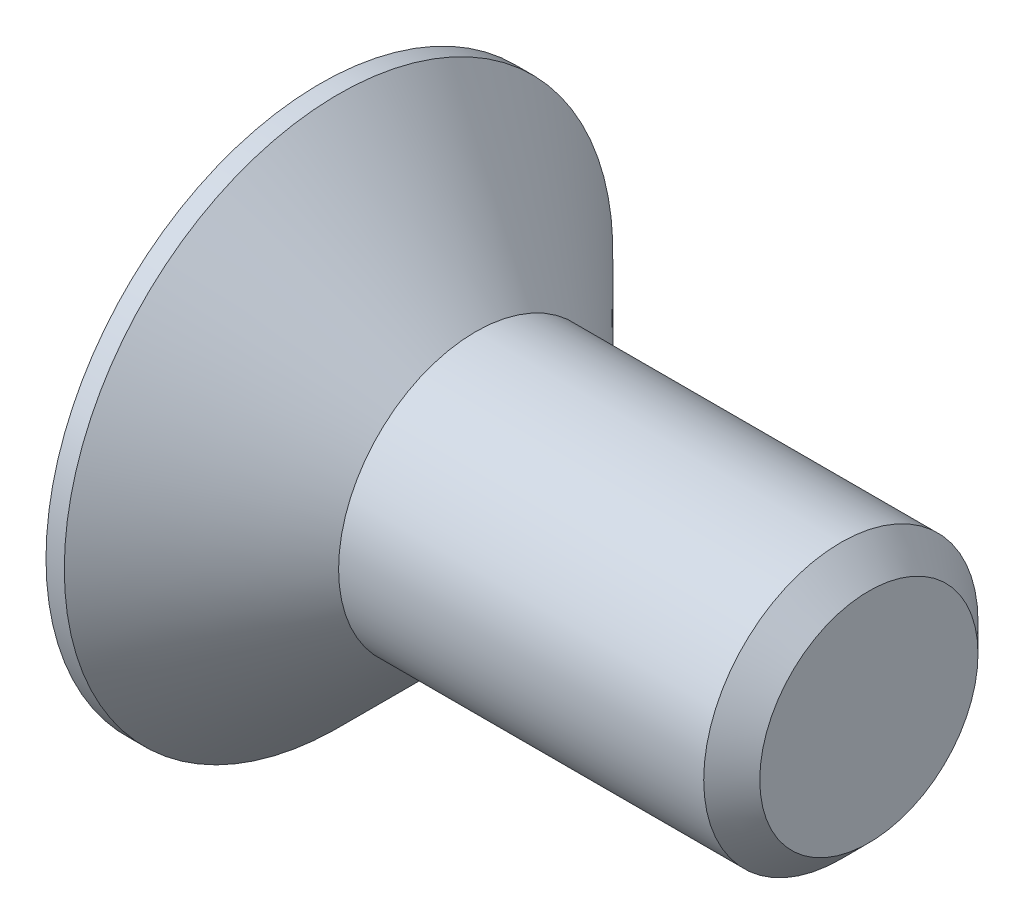
ISO-10303-21;
HEADER;
FILE_DESCRIPTION(('STEP AP214'),'2;1');
FILE_NAME('part.step','',(''),(''),'','','');
FILE_SCHEMA(('AUTOMOTIVE_DESIGN { 1 0 10303 214 1 1 1 1 }'));
ENDSEC;
DATA;
#1=APPLICATION_CONTEXT('core data for automotive mechanical design processes');
#2=APPLICATION_PROTOCOL_DEFINITION('international standard','automotive_design',2000,#1);
#3=PRODUCT_CONTEXT('',#1,'mechanical');
#4=PRODUCT('Part','Part','',(#3));
#5=PRODUCT_RELATED_PRODUCT_CATEGORY('part','',(#4));
#6=PRODUCT_DEFINITION_FORMATION('','',#4);
#7=PRODUCT_DEFINITION_CONTEXT('part definition',#1,'design');
#8=PRODUCT_DEFINITION('design','',#6,#7);
#9=PRODUCT_DEFINITION_SHAPE('','',#8);
#10=(LENGTH_UNIT() NAMED_UNIT(*) SI_UNIT(.MILLI.,.METRE.));
#11=(NAMED_UNIT(*) PLANE_ANGLE_UNIT() SI_UNIT($,.RADIAN.));
#12=(NAMED_UNIT(*) SI_UNIT($,.STERADIAN.) SOLID_ANGLE_UNIT());
#13=UNCERTAINTY_MEASURE_WITH_UNIT(LENGTH_MEASURE(1.E-05),#10,'distance_accuracy_value','');
#14=(GEOMETRIC_REPRESENTATION_CONTEXT(3) GLOBAL_UNCERTAINTY_ASSIGNED_CONTEXT((#13)) GLOBAL_UNIT_ASSIGNED_CONTEXT((#10,
#11,#12)) REPRESENTATION_CONTEXT('',''));
#15=CARTESIAN_POINT('',(0.,0.,0.));
#16=DIRECTION('',(0.,0.,1.));
#17=DIRECTION('',(1.,0.,0.));
#18=AXIS2_PLACEMENT_3D('',#15,#16,#17);
#19=CARTESIAN_POINT('',(4.3,0.,-0.59675));
#20=DIRECTION('',(1.,0.,0.));
#21=DIRECTION('',(0.,0.,-1.));
#22=AXIS2_PLACEMENT_3D('',#19,#20,#21);
#23=PLANE('',#22);
#24=CARTESIAN_POINT('',(4.30000000000064,0.,0.));
#25=DIRECTION('',(-1.,0.,0.));
#26=DIRECTION('',(0.,0.,1.));
#27=AXIS2_PLACEMENT_3D('',#24,#25,#26);
#28=CIRCLE('',#27,1.1934999999994);
#29=CARTESIAN_POINT('',(4.30000000000064,0.,1.1934999999994));
#30=VERTEX_POINT('',#29);
#31=EDGE_CURVE('E19',#30,#30,#28,.T.);
#32=ORIENTED_EDGE('',*,*,#31,.F.);
#33=EDGE_LOOP('',(#32));
#34=FACE_BOUND('',#33,.T.);
#35=ADVANCED_FACE('F16',(#34),#23,.T.);
#36=CARTESIAN_POINT('',(3.99349999997867,0.,0.));
#37=DIRECTION('',(-1.,0.,0.));
#38=DIRECTION('',(0.,0.,1.));
#39=AXIS2_PLACEMENT_3D('',#36,#37,#38);
#40=CONICAL_SURFACE('',#39,1.50000000002137,0.785398163397448);
#41=CARTESIAN_POINT('',(3.9935,0.,0.));
#42=DIRECTION('',(-1.,0.,0.));
#43=DIRECTION('',(0.,0.,1.));
#44=AXIS2_PLACEMENT_3D('',#41,#42,#43);
#45=CIRCLE('',#44,1.5);
#46=CARTESIAN_POINT('',(3.9935,0.,1.5));
#47=VERTEX_POINT('',#46);
#48=EDGE_CURVE('E332',#47,#47,#45,.T.);
#49=ORIENTED_EDGE('',*,*,#48,.F.);
#50=EDGE_LOOP('',(#49));
#51=FACE_BOUND('',#50,.T.);
#52=ORIENTED_EDGE('',*,*,#31,.T.);
#53=EDGE_LOOP('',(#52));
#54=FACE_BOUND('',#53,.T.);
#55=ADVANCED_FACE('F117',(#51,#54),#40,.T.);
#56=CARTESIAN_POINT('',(-0.422649730978719,0.,-2.27373675443232E-10));
#57=DIRECTION('',(-1.,0.,0.));
#58=DIRECTION('',(0.,0.,1.));
#59=AXIS2_PLACEMENT_3D('',#56,#57,#58);
#60=CONICAL_SURFACE('',#59,0.,1.04719755120245);
#61=CARTESIAN_POINT('',(-1.,0.,0.));
#62=DIRECTION('',(-1.,0.,0.));
#63=DIRECTION('',(0.,0.,1.));
#64=AXIS2_PLACEMENT_3D('',#61,#62,#63);
#65=CIRCLE('',#64,1.);
#66=CARTESIAN_POINT('',(-1.,0.,1.));
#67=VERTEX_POINT('',#66);
#68=EDGE_CURVE('E338',#67,#67,#65,.F.);
#69=ORIENTED_EDGE('',*,*,#68,.F.);
#70=EDGE_LOOP('',(#69));
#71=FACE_BOUND('',#70,.T.);
#72=CARTESIAN_POINT('',(-0.422649730893454,0.,-1.4210854715202E-10));
#73=VERTEX_POINT('',#72);
#74=VERTEX_LOOP('',#73);
#75=FACE_BOUND('',#74,.T.);
#76=ADVANCED_FACE('F114',(#71,#75),#60,.F.);
#77=CARTESIAN_POINT('',(1.99675,0.,0.));
#78=DIRECTION('',(-1.,0.,0.));
#79=DIRECTION('',(0.,0.,1.));
#80=AXIS2_PLACEMENT_3D('',#77,#78,#79);
#81=CYLINDRICAL_SURFACE('',#80,1.5);
#82=CARTESIAN_POINT('',(5.6843418860808E-11,0.,0.));
#83=DIRECTION('',(-1.,0.,0.));
#84=DIRECTION('',(0.,0.,-1.));
#85=AXIS2_PLACEMENT_3D('',#82,#83,#84);
#86=CIRCLE('',#85,1.50000000002137);
#87=CARTESIAN_POINT('',(5.6843418860808E-11,0.,-1.50000000002137));
#88=VERTEX_POINT('',#87);
#89=EDGE_CURVE('E335',#88,#88,#86,.T.);
#90=ORIENTED_EDGE('',*,*,#89,.F.);
#91=EDGE_LOOP('',(#90));
#92=FACE_BOUND('',#91,.T.);
#93=ORIENTED_EDGE('',*,*,#48,.T.);
#94=EDGE_LOOP('',(#93));
#95=FACE_BOUND('',#94,.T.);
#96=ADVANCED_FACE('F116',(#92,#95),#81,.T.);
#97=CARTESIAN_POINT('',(-1.7,-1.15470053837925,0.));
#98=DIRECTION('',(0.,-0.866025403784439,0.5));
#99=DIRECTION('',(0.,-0.5,-0.866025403784439));
#100=AXIS2_PLACEMENT_3D('',#97,#98,#99);
#101=PLANE('',#100);
#102=DIRECTION('',(1.,0.,0.));
#103=VECTOR('',#102,1.);
#104=CARTESIAN_POINT('',(-1.7,-0.577350269189626,1.));
#105=LINE('',#104,#103);
#106=CARTESIAN_POINT('',(-1.14759373948567,-0.577350286885905,0.999999969349146));
#107=VERTEX_POINT('',#106);
#108=CARTESIAN_POINT('',(-1.,-0.577350269189626,1.));
#109=VERTEX_POINT('',#108);
#110=EDGE_CURVE('E110',#107,#109,#105,.T.);
#111=ORIENTED_EDGE('',*,*,#110,.T.);
#112=DIRECTION('',(0.,0.5,0.866025403784439));
#113=VECTOR('',#112,1.);
#114=CARTESIAN_POINT('',(-1.,-0.806309265446615,0.603431385632923));
#115=LINE('',#114,#113);
#116=CARTESIAN_POINT('',(-1.0000000000166,-0.806309265331264,0.603431385832717));
#117=VERTEX_POINT('',#116);
#118=EDGE_CURVE('E328',#117,#109,#115,.T.);
#119=ORIENTED_EDGE('',*,*,#118,.F.);
#120=CARTESIAN_POINT('',(-1.14759372178939,-0.577350304582184,0.999999938698292));
#121=CARTESIAN_POINT('',(-1.12954944072011,-0.595412849027873,0.968714694004388));
#122=CARTESIAN_POINT('',(-1.11247494388711,-0.613742226589959,0.93696728079574));
#123=CARTESIAN_POINT('',(-1.08107101419316,-0.65081473605964,0.872755810830176));
#124=CARTESIAN_POINT('',(-1.06672209185628,-0.669553771913611,0.840298848646243));
#125=CARTESIAN_POINT('',(-1.04126381454519,-0.707627146696671,0.774353829106371));
#126=CARTESIAN_POINT('',(-1.03016013131735,-0.726962463341887,0.740864078296425));
#127=CARTESIAN_POINT('',(-1.01188380688286,-0.766239414796476,0.672834402810659));
#128=CARTESIAN_POINT('',(-1.00474129164731,-0.78618451081379,0.638288483146832));
#129=CARTESIAN_POINT('',(-0.999999999989702,-0.806309265444663,0.603431385636304));
#130=B_SPLINE_CURVE_WITH_KNOTS('',3,(#120,#121,#122,#123,#124,#125,#126,#127,#128,#129),
.UNSPECIFIED.,.F.,.F.,(4,2,2,2,4),(0.,0.121192343368842,0.241482464220631,0.361981577456356,
0.483384980238341),.UNSPECIFIED.);
#131=EDGE_CURVE('E90',#107,#117,#130,.T.);
#132=ORIENTED_EDGE('',*,*,#131,.F.);
#133=EDGE_LOOP('',(#111,#119,#132));
#134=FACE_BOUND('',#133,.T.);
#135=ADVANCED_FACE('F125',(#134),#101,.F.);
#136=CARTESIAN_POINT('',(-1.,0.,0.));
#137=DIRECTION('',(-1.,0.,0.));
#138=DIRECTION('',(0.,0.,1.));
#139=AXIS2_PLACEMENT_3D('',#136,#137,#138);
#140=PLANE('',#139);
#141=ORIENTED_EDGE('',*,*,#118,.T.);
#142=DIRECTION('',(0.,1.,0.));
#143=VECTOR('',#142,1.);
#144=CARTESIAN_POINT('',(-1.,-0.577350269189626,1.));
#145=LINE('',#144,#143);
#146=CARTESIAN_POINT('',(-1.00000000001151,-0.119432276863416,1.));
#147=VERTEX_POINT('',#146);
#148=EDGE_CURVE('E321',#109,#147,#145,.T.);
#149=ORIENTED_EDGE('',*,*,#148,.T.);
#150=CARTESIAN_POINT('',(-1.0000000000332,0.,0.));
#151=DIRECTION('',(-1.,0.,0.));
#152=DIRECTION('',(0.,0.,1.));
#153=AXIS2_PLACEMENT_3D('',#150,#151,#152);
#154=CIRCLE('',#153,1.0071067812305);
#155=EDGE_CURVE('E616',#117,#147,#154,.T.);
#156=ORIENTED_EDGE('',*,*,#155,.F.);
#157=EDGE_LOOP('',(#141,#149,#156));
#158=FACE_BOUND('',#157,.T.);
#159=ADVANCED_FACE('F478',(#158),#140,.T.);
#160=CARTESIAN_POINT('',(-1.7,-0.577350269189626,1.));
#161=DIRECTION('',(0.,0.,1.));
#162=DIRECTION('',(1.,0.,0.));
#163=AXIS2_PLACEMENT_3D('',#160,#161,#162);
#164=PLANE('',#163);
#165=ORIENTED_EDGE('',*,*,#148,.F.);
#166=ORIENTED_EDGE('',*,*,#110,.F.);
#167=CARTESIAN_POINT('',(-0.999999999987139,-0.119432276680836,1.00000000000645));
#168=CARTESIAN_POINT('',(-1.00814409308643,-0.188516207510361,1.00000000000219));
#169=CARTESIAN_POINT('',(-1.02327258447582,-0.256227448885397,1.00000000000056));
#170=CARTESIAN_POINT('',(-1.0636670115996,-0.387857291852068,0.999999999999449));
#171=CARTESIAN_POINT('',(-1.08882313241476,-0.45180863545373,0.999999999999949));
#172=CARTESIAN_POINT('',(-1.12215456162329,-0.52470971425236,1.00000000000001));
#173=CARTESIAN_POINT('',(-1.12710949189751,-0.535286905313362,1.));
#174=CARTESIAN_POINT('',(-1.13721167384597,-0.556372617052235,0.999999999999996));
#175=CARTESIAN_POINT('',(-1.14235925727663,-0.56688097885376,0.999999999999991));
#176=CARTESIAN_POINT('',(-1.14759376424623,-0.577350283318192,1.));
#177=B_SPLINE_CURVE_WITH_KNOTS('',3,(#167,#168,#169,#170,#171,#172,#173,#174,#175,#176),
.UNSPECIFIED.,.F.,.F.,(4,2,2,2,4),(0.,0.207588466124368,0.412963431373876,0.448006551946835,
0.483113077965665),.UNSPECIFIED.);
#178=EDGE_CURVE('E205',#147,#107,#177,.T.);
#179=ORIENTED_EDGE('',*,*,#178,.F.);
#180=EDGE_LOOP('',(#165,#166,#179));
#181=FACE_BOUND('',#180,.T.);
#182=ADVANCED_FACE('F471',(#181),#164,.F.);
#183=CARTESIAN_POINT('',(-1.7,-0.577350269189626,-1.));
#184=DIRECTION('',(0.,-0.866025403784439,-0.5));
#185=DIRECTION('',(0.,0.5,-0.866025403784439));
#186=AXIS2_PLACEMENT_3D('',#183,#184,#185);
#187=PLANE('',#186);
#188=DIRECTION('',(1.,0.,0.));
#189=VECTOR('',#188,1.);
#190=CARTESIAN_POINT('',(-1.7,-1.15470053837925,0.));
#191=LINE('',#190,#189);
#192=CARTESIAN_POINT('',(-1.14759373949233,-1.15470052068964,-3.06393051299847E-08));
#193=VERTEX_POINT('',#192);
#194=CARTESIAN_POINT('',(-1.,-1.15470053837925,0.));
#195=VERTEX_POINT('',#194);
#196=EDGE_CURVE('E312',#193,#195,#191,.T.);
#197=ORIENTED_EDGE('',*,*,#196,.T.);
#198=DIRECTION('',(0.,-0.5,0.866025403784438));
#199=VECTOR('',#198,1.);
#200=CARTESIAN_POINT('',(-1.,-0.925741542122263,-0.396568614367076));
#201=LINE('',#200,#199);
#202=CARTESIAN_POINT('',(-1.0000000000166,-0.925741542237614,-0.396568614167282));
#203=VERTEX_POINT('',#202);
#204=EDGE_CURVE('E316',#203,#195,#201,.T.);
#205=ORIENTED_EDGE('',*,*,#204,.F.);
#206=CARTESIAN_POINT('',(-1.14759372180272,-1.15470050300003,-6.12786103922624E-08));
#207=CARTESIAN_POINT('',(-1.12954944073184,-1.13663795855335,-0.0312853059742306));
#208=CARTESIAN_POINT('',(-1.11247494389727,-1.11830858099025,-0.0630327191846376));
#209=CARTESIAN_POINT('',(-1.08107101420043,-1.08123607151849,-0.127244189153799));
#210=CARTESIAN_POINT('',(-1.06672209186221,-1.06249703566346,-0.159701151339567));
#211=CARTESIAN_POINT('',(-1.04126381454874,-1.0244236608782,-0.225646170883251));
#212=CARTESIAN_POINT('',(-1.03016013131987,-1.00508834423184,-0.259135921695176));
#213=CARTESIAN_POINT('',(-1.01188380688374,-0.965811392774883,-0.327165597185042));
#214=CARTESIAN_POINT('',(-1.0047412916476,-0.945866296756342,-0.361711516850995));
#215=CARTESIAN_POINT('',(-0.999999999989702,-0.925741542124215,-0.396568614363695));
#216=B_SPLINE_CURVE_WITH_KNOTS('',3,(#206,#207,#208,#209,#210,#211,#212,#213,#214,#215),
.UNSPECIFIED.,.F.,.F.,(4,2,2,2,4),(0.,0.12119234337633,0.241482464235481,0.361981577478616,
0.483384980268136),.UNSPECIFIED.);
#217=EDGE_CURVE('E190',#193,#203,#216,.T.);
#218=ORIENTED_EDGE('',*,*,#217,.F.);
#219=EDGE_LOOP('',(#197,#205,#218));
#220=FACE_BOUND('',#219,.T.);
#221=ADVANCED_FACE('F463',(#220),#187,.F.);
#222=CARTESIAN_POINT('',(-1.,0.,0.));
#223=DIRECTION('',(-1.,0.,0.));
#224=DIRECTION('',(0.,0.,1.));
#225=AXIS2_PLACEMENT_3D('',#222,#223,#224);
#226=PLANE('',#225);
#227=ORIENTED_EDGE('',*,*,#204,.T.);
#228=DIRECTION('',(0.,-0.5,-0.866025403784439));
#229=VECTOR('',#228,1.);
#230=CARTESIAN_POINT('',(-1.,-1.15470053837925,0.));
#231=LINE('',#230,#229);
#232=CARTESIAN_POINT('',(-1.00000000001151,-0.925741542216146,0.396568614204466));
#233=VERTEX_POINT('',#232);
#234=EDGE_CURVE('E308',#195,#233,#231,.F.);
#235=ORIENTED_EDGE('',*,*,#234,.T.);
#236=CARTESIAN_POINT('',(-1.0000000000332,0.,0.));
#237=DIRECTION('',(-1.,0.,0.));
#238=DIRECTION('',(0.,0.,1.));
#239=AXIS2_PLACEMENT_3D('',#236,#237,#238);
#240=CIRCLE('',#239,1.0071067812305);
#241=EDGE_CURVE('E620',#203,#233,#240,.T.);
#242=ORIENTED_EDGE('',*,*,#241,.F.);
#243=EDGE_LOOP('',(#227,#235,#242));
#244=FACE_BOUND('',#243,.T.);
#245=ADVANCED_FACE('F456',(#244),#226,.T.);
#246=CARTESIAN_POINT('',(-1.7,-1.15470053837925,0.));
#247=DIRECTION('',(0.,-0.866025403784439,0.5));
#248=DIRECTION('',(0.,-0.5,-0.866025403784439));
#249=AXIS2_PLACEMENT_3D('',#246,#247,#248);
#250=PLANE('',#249);
#251=ORIENTED_EDGE('',*,*,#234,.F.);
#252=ORIENTED_EDGE('',*,*,#196,.F.);
#253=CARTESIAN_POINT('',(-0.999999999987139,-0.925741542130439,0.396568614365809));
#254=CARTESIAN_POINT('',(-1.00814409308643,-0.960283507541523,0.336740175272009));
#255=CARTESIAN_POINT('',(-1.02327258447583,-0.994139128227632,0.278100520118625));
#256=CARTESIAN_POINT('',(-1.0636670115996,-1.05995404971,0.164105732212784));
#257=CARTESIAN_POINT('',(-1.08882313241476,-1.09192972151126,0.10872224404786));
#258=CARTESIAN_POINT('',(-1.12215456162545,-1.12838026091299,0.0455880578409002));
#259=CARTESIAN_POINT('',(-1.12710949190191,-1.13366885644582,0.0364279416773376));
#260=CARTESIAN_POINT('',(-1.13721167385503,-1.1442117123199,0.0181671796465418));
#261=CARTESIAN_POINT('',(-1.1423592572881,-1.14946589322297,0.00906667137026032));
#262=CARTESIAN_POINT('',(-1.14759376426018,-1.15470054545748,-1.22598580700511E-08));
#263=B_SPLINE_CURVE_WITH_KNOTS('',3,(#253,#254,#255,#256,#257,#258,#259,#260,#261,#262),
.UNSPECIFIED.,.F.,.F.,(4,2,2,2,4),(0.,0.207588466124403,0.412963431373875,0.448006551962401,
0.483113077996857),.UNSPECIFIED.);
#264=EDGE_CURVE('E181',#233,#193,#263,.T.);
#265=ORIENTED_EDGE('',*,*,#264,.F.);
#266=EDGE_LOOP('',(#251,#252,#265));
#267=FACE_BOUND('',#266,.T.);
#268=ADVANCED_FACE('F449',(#267),#250,.F.);
#269=CARTESIAN_POINT('',(-1.7,0.577350269189626,-1.));
#270=DIRECTION('',(0.,0.,-1.));
#271=DIRECTION('',(-1.,0.,0.));
#272=AXIS2_PLACEMENT_3D('',#269,#270,#271);
#273=PLANE('',#272);
#274=DIRECTION('',(1.,0.,0.));
#275=VECTOR('',#274,1.);
#276=CARTESIAN_POINT('',(-1.7,-0.577350269189626,-1.));
#277=LINE('',#276,#275);
#278=CARTESIAN_POINT('',(-1.14759373949233,-0.577350233810404,-1.));
#279=VERTEX_POINT('',#278);
#280=CARTESIAN_POINT('',(-1.,-0.577350269189626,-1.));
#281=VERTEX_POINT('',#280);
#282=EDGE_CURVE('E299',#279,#281,#277,.T.);
#283=ORIENTED_EDGE('',*,*,#282,.T.);
#284=DIRECTION('',(0.,1.,0.));
#285=VECTOR('',#284,1.);
#286=CARTESIAN_POINT('',(-1.,0.,-1.));
#287=LINE('',#286,#285);
#288=CARTESIAN_POINT('',(-1.0000000000166,-0.119432276906352,-1.));
#289=VERTEX_POINT('',#288);
#290=EDGE_CURVE('E303',#289,#281,#287,.F.);
#291=ORIENTED_EDGE('',*,*,#290,.F.);
#292=CARTESIAN_POINT('',(-1.14759372180272,-0.577350198431181,-1.));
#293=CARTESIAN_POINT('',(-1.12954944073184,-0.541225109537822,-1.));
#294=CARTESIAN_POINT('',(-1.11247494389727,-0.504566354411617,-1.));
#295=CARTESIAN_POINT('',(-1.08107101420043,-0.430421335468103,-1.));
#296=CARTESIAN_POINT('',(-1.06672209186221,-0.392943263758041,-1.));
#297=CARTESIAN_POINT('',(-1.04126381454874,-0.316796514187519,-1.));
#298=CARTESIAN_POINT('',(-1.03016013131987,-0.278125880894804,-1.));
#299=CARTESIAN_POINT('',(-1.01188380688374,-0.199571977980889,-1.));
#300=CARTESIAN_POINT('',(-1.0047412916476,-0.159681785943807,-1.));
#301=CARTESIAN_POINT('',(-0.999999999989702,-0.119432276679554,-1.));
#302=B_SPLINE_CURVE_WITH_KNOTS('',3,(#292,#293,#294,#295,#296,#297,#298,#299,#300,#301),
.UNSPECIFIED.,.F.,.F.,(4,2,2,2,4),(0.,0.12119234337633,0.241482464235481,0.361981577478615,
0.483384980268136),.UNSPECIFIED.);
#303=EDGE_CURVE('E173',#279,#289,#302,.T.);
#304=ORIENTED_EDGE('',*,*,#303,.F.);
#305=EDGE_LOOP('',(#283,#291,#304));
#306=FACE_BOUND('',#305,.T.);
#307=ADVANCED_FACE('F442',(#306),#273,.F.);
#308=CARTESIAN_POINT('',(-1.,0.,0.));
#309=DIRECTION('',(-1.,0.,0.));
#310=DIRECTION('',(0.,0.,1.));
#311=AXIS2_PLACEMENT_3D('',#308,#309,#310);
#312=PLANE('',#311);
#313=ORIENTED_EDGE('',*,*,#290,.T.);
#314=DIRECTION('',(0.,0.5,-0.866025403784439));
#315=VECTOR('',#314,1.);
#316=CARTESIAN_POINT('',(-1.,-0.577350269189626,-1.));
#317=LINE('',#316,#315);
#318=CARTESIAN_POINT('',(-1.00000000001151,-0.806309265352731,-0.603431385795534));
#319=VERTEX_POINT('',#318);
#320=EDGE_CURVE('E289',#281,#319,#317,.F.);
#321=ORIENTED_EDGE('',*,*,#320,.T.);
#322=CARTESIAN_POINT('',(-1.0000000000332,0.,0.));
#323=DIRECTION('',(-1.,0.,0.));
#324=DIRECTION('',(0.,0.,1.));
#325=AXIS2_PLACEMENT_3D('',#322,#323,#324);
#326=CIRCLE('',#325,1.0071067812305);
#327=EDGE_CURVE('E627',#289,#319,#326,.T.);
#328=ORIENTED_EDGE('',*,*,#327,.F.);
#329=EDGE_LOOP('',(#313,#321,#328));
#330=FACE_BOUND('',#329,.T.);
#331=ADVANCED_FACE('F435',(#330),#312,.T.);
#332=CARTESIAN_POINT('',(-1.7,-0.577350269189626,-1.));
#333=DIRECTION('',(0.,-0.866025403784439,-0.5));
#334=DIRECTION('',(0.,0.5,-0.866025403784439));
#335=AXIS2_PLACEMENT_3D('',#332,#333,#334);
#336=PLANE('',#335);
#337=ORIENTED_EDGE('',*,*,#320,.F.);
#338=ORIENTED_EDGE('',*,*,#282,.F.);
#339=CARTESIAN_POINT('',(-0.999999999987139,-0.806309265449604,-0.603431385640638));
#340=CARTESIAN_POINT('',(-1.00814409308643,-0.771767300031146,-0.663259824730181));
#341=CARTESIAN_POINT('',(-1.02327258447583,-0.73791167934221,-0.721899479881933));
#342=CARTESIAN_POINT('',(-1.0636670115996,-0.672096757857918,-0.835894267786666));
#343=CARTESIAN_POINT('',(-1.08882313241476,-0.640121086057528,-0.89127775595209));
#344=CARTESIAN_POINT('',(-1.12215456162545,-0.603670546655906,-0.954411942159109));
#345=CARTESIAN_POINT('',(-1.12710949190191,-0.598381951123063,-0.963572058322667));
#346=CARTESIAN_POINT('',(-1.13721167385503,-0.58783909524897,-0.981832820353454));
#347=CARTESIAN_POINT('',(-1.1423592572881,-0.582584914345895,-0.990933328629731));
#348=CARTESIAN_POINT('',(-1.14759376426018,-0.577350262111394,-1.00000001225986));
#349=B_SPLINE_CURVE_WITH_KNOTS('',3,(#339,#340,#341,#342,#343,#344,#345,#346,#347,#348),
.UNSPECIFIED.,.F.,.F.,(4,2,2,2,4),(0.,0.207588466124403,0.412963431373875,0.448006551962401,
0.483113077996856),.UNSPECIFIED.);
#350=EDGE_CURVE('E164',#319,#279,#349,.T.);
#351=ORIENTED_EDGE('',*,*,#350,.F.);
#352=EDGE_LOOP('',(#337,#338,#351));
#353=FACE_BOUND('',#352,.T.);
#354=ADVANCED_FACE('F263',(#353),#336,.F.);
#355=CARTESIAN_POINT('',(-1.7,0.577350269189626,1.));
#356=DIRECTION('',(0.,0.866025403784439,0.5));
#357=DIRECTION('',(0.,-0.5,0.866025403784439));
#358=AXIS2_PLACEMENT_3D('',#355,#356,#357);
#359=PLANE('',#358);
#360=DIRECTION('',(1.,0.,0.));
#361=VECTOR('',#360,1.);
#362=CARTESIAN_POINT('',(-1.7,1.15470053837925,0.));
#363=LINE('',#362,#361);
#364=CARTESIAN_POINT('',(-1.14759373948839,1.1547005206857,3.06461281133559E-08));
#365=VERTEX_POINT('',#364);
#366=CARTESIAN_POINT('',(-1.,1.15470053837925,0.));
#367=VERTEX_POINT('',#366);
#368=EDGE_CURVE('E283',#365,#367,#363,.T.);
#369=ORIENTED_EDGE('',*,*,#368,.T.);
#370=DIRECTION('',(0.,0.5,-0.866025403784438));
#371=VECTOR('',#370,1.);
#372=CARTESIAN_POINT('',(-1.,0.925741542122263,0.396568614367076));
#373=LINE('',#372,#371);
#374=CARTESIAN_POINT('',(-1.0000000000166,0.925741542237614,0.396568614167282));
#375=VERTEX_POINT('',#374);
#376=EDGE_CURVE('E285',#375,#367,#373,.T.);
#377=ORIENTED_EDGE('',*,*,#376,.F.);
#378=CARTESIAN_POINT('',(-1.14759372179302,1.15470050299621,6.12935451049619E-08));
#379=CARTESIAN_POINT('',(-1.12954944072428,1.13663795854755,0.0312853059872758));
#380=CARTESIAN_POINT('',(-1.11247494389114,1.11830858098399,0.0630327191962706));
#381=CARTESIAN_POINT('',(-1.08107101419636,1.0812360715127,0.127244189163026));
#382=CARTESIAN_POINT('',(-1.0667220918588,1.06249703565858,0.159701151347798));
#383=CARTESIAN_POINT('',(-1.04126381454662,1.02442366087482,0.225646170889331));
#384=CARTESIAN_POINT('',(-1.03016013131837,1.00508834422906,0.259135921700099));
#385=CARTESIAN_POINT('',(-1.01188380688325,0.965811392773371,0.327165597187546));
#386=CARTESIAN_POINT('',(-1.00474129164748,0.945866296755493,0.361711516852233));
#387=CARTESIAN_POINT('',(-0.999999999989702,0.925741542124215,0.396568614363696));
#388=B_SPLINE_CURVE_WITH_KNOTS('',3,(#378,#379,#380,#381,#382,#383,#384,#385,#386,#387),
.UNSPECIFIED.,.F.,.F.,(4,2,2,2,4),(0.,0.121192343371831,0.241482464226626,0.361981577465498,
0.483384980250595),.UNSPECIFIED.);
#389=EDGE_CURVE('E267',#365,#375,#388,.T.);
#390=ORIENTED_EDGE('',*,*,#389,.F.);
#391=EDGE_LOOP('',(#369,#377,#390));
#392=FACE_BOUND('',#391,.T.);
#393=ADVANCED_FACE('F259',(#392),#359,.F.);
#394=CARTESIAN_POINT('',(-1.,0.,0.));
#395=DIRECTION('',(-1.,0.,0.));
#396=DIRECTION('',(0.,0.,1.));
#397=AXIS2_PLACEMENT_3D('',#394,#395,#396);
#398=PLANE('',#397);
#399=ORIENTED_EDGE('',*,*,#376,.T.);
#400=DIRECTION('',(0.,0.5,0.866025403784439));
#401=VECTOR('',#400,1.);
#402=CARTESIAN_POINT('',(-1.,1.15470053837925,0.));
#403=LINE('',#402,#401);
#404=CARTESIAN_POINT('',(-1.00000000001151,0.925741542216146,-0.396568614204466));
#405=VERTEX_POINT('',#404);
#406=EDGE_CURVE('E282',#367,#405,#403,.F.);
#407=ORIENTED_EDGE('',*,*,#406,.T.);
#408=CARTESIAN_POINT('',(-1.0000000000332,0.,0.));
#409=DIRECTION('',(-1.,0.,0.));
#410=DIRECTION('',(0.,0.,1.));
#411=AXIS2_PLACEMENT_3D('',#408,#409,#410);
#412=CIRCLE('',#411,1.0071067812305);
#413=EDGE_CURVE('E273',#375,#405,#412,.T.);
#414=ORIENTED_EDGE('',*,*,#413,.F.);
#415=EDGE_LOOP('',(#399,#407,#414));
#416=FACE_BOUND('',#415,.T.);
#417=ADVANCED_FACE('F255',(#416),#398,.T.);
#418=CARTESIAN_POINT('',(-1.7,1.15470053837925,0.));
#419=DIRECTION('',(0.,0.866025403784439,-0.5));
#420=DIRECTION('',(0.,0.5,0.866025403784439));
#421=AXIS2_PLACEMENT_3D('',#418,#419,#420);
#422=PLANE('',#421);
#423=ORIENTED_EDGE('',*,*,#406,.F.);
#424=ORIENTED_EDGE('',*,*,#368,.F.);
#425=CARTESIAN_POINT('',(-0.999999999987139,0.925741542130439,-0.396568614365809));
#426=CARTESIAN_POINT('',(-1.00814409308644,0.960283507541529,-0.336740175272));
#427=CARTESIAN_POINT('',(-1.02327258447583,0.99413912822764,-0.278100520118612));
#428=CARTESIAN_POINT('',(-1.06366701159961,1.05995404971001,-0.164105732212774));
#429=CARTESIAN_POINT('',(-1.08882313241477,1.09192972151126,-0.108722244047858));
#430=CARTESIAN_POINT('',(-1.12215456162667,1.12838026091432,-0.0455880578385909));
#431=CARTESIAN_POINT('',(-1.1271094919044,1.13366885644848,-0.03642794167274));
#432=CARTESIAN_POINT('',(-1.13721167386015,1.14421171232518,-0.0181671796373971));
#433=CARTESIAN_POINT('',(-1.14235925729458,1.14946589322955,-0.00906667135885673));
#434=CARTESIAN_POINT('',(-1.14759376426805,1.15470054546536,1.22735038750435E-08));
#435=B_SPLINE_CURVE_WITH_KNOTS('',3,(#425,#426,#427,#428,#429,#430,#431,#432,#433,#434),
.UNSPECIFIED.,.F.,.F.,(4,2,2,2,4),(0.,0.207588466124423,0.412963431373874,0.448006551971193,
0.483113078014473),.UNSPECIFIED.);
#436=EDGE_CURVE('E152',#405,#365,#435,.T.);
#437=ORIENTED_EDGE('',*,*,#436,.F.);
#438=EDGE_LOOP('',(#423,#424,#437));
#439=FACE_BOUND('',#438,.T.);
#440=ADVANCED_FACE('F248',(#439),#422,.F.);
#441=CARTESIAN_POINT('',(-1.7,0.577350269189626,1.));
#442=DIRECTION('',(0.,0.866025403784439,0.5));
#443=DIRECTION('',(0.,-0.5,0.866025403784439));
#444=AXIS2_PLACEMENT_3D('',#441,#442,#443);
#445=PLANE('',#444);
#446=DIRECTION('',(0.,0.5,-0.866025403784439));
#447=VECTOR('',#446,1.);
#448=CARTESIAN_POINT('',(-1.,0.577350269189626,1.));
#449=LINE('',#448,#447);
#450=CARTESIAN_POINT('',(-1.,0.577350269189626,1.));
#451=VERTEX_POINT('',#450);
#452=CARTESIAN_POINT('',(-1.00000000001151,0.806309265352731,0.603431385795534));
#453=VERTEX_POINT('',#452);
#454=EDGE_CURVE('E361',#451,#453,#449,.T.);
#455=ORIENTED_EDGE('',*,*,#454,.F.);
#456=DIRECTION('',(1.,0.,0.));
#457=VECTOR('',#456,1.);
#458=CARTESIAN_POINT('',(-1.7,0.577350269189626,1.));
#459=LINE('',#458,#457);
#460=CARTESIAN_POINT('',(-1.14759376072143,0.57735027626859,1.));
#461=VERTEX_POINT('',#460);
#462=EDGE_CURVE('E287',#451,#461,#459,.F.);
#463=ORIENTED_EDGE('',*,*,#462,.T.);
#464=CARTESIAN_POINT('',(-0.999999999987139,0.806309265449604,0.603431385640638));
#465=CARTESIAN_POINT('',(-1.00814409307334,0.771767300058917,0.663259824682081));
#466=CARTESIAN_POINT('',(-1.02327258445552,0.73791167938261,0.721899479811959));
#467=CARTESIAN_POINT('',(-1.06366701157717,0.672096757887245,0.835894267735871));
#468=CARTESIAN_POINT('',(-1.0888231324082,0.640121086064763,0.891277755939559));
#469=CARTESIAN_POINT('',(-1.12215455505538,0.603670553840786,0.954411929714533));
#470=CARTESIAN_POINT('',(-1.12710947850026,0.598381965427245,0.963572033547098));
#471=CARTESIAN_POINT('',(-1.13721164628675,0.587839123701442,0.981832771072329));
#472=CARTESIAN_POINT('',(-1.14235922238343,0.582584949827026,0.990933267174609));
#473=CARTESIAN_POINT('',(-1.14759372180199,0.577350304569579,0.999999938720124));
#474=B_SPLINE_CURVE_WITH_KNOTS('',3,(#464,#465,#466,#467,#468,#469,#470,#471,#472,#473),
.UNSPECIFIED.,.F.,.F.,(4,2,2,2,4),(0.,0.207588466015654,0.412963431374018,0.448006504583425,
0.48311298306106),.UNSPECIFIED.);
#475=EDGE_CURVE('E237',#453,#461,#474,.T.);
#476=ORIENTED_EDGE('',*,*,#475,.F.);
#477=EDGE_LOOP('',(#455,#463,#476));
#478=FACE_BOUND('',#477,.T.);
#479=ADVANCED_FACE('F244',(#478),#445,.F.);
#480=CARTESIAN_POINT('',(-1.7,-0.577350269189626,1.));
#481=DIRECTION('',(0.,0.,1.));
#482=DIRECTION('',(1.,0.,0.));
#483=AXIS2_PLACEMENT_3D('',#480,#481,#482);
#484=PLANE('',#483);
#485=ORIENTED_EDGE('',*,*,#462,.F.);
#486=DIRECTION('',(0.,1.,0.));
#487=VECTOR('',#486,1.);
#488=CARTESIAN_POINT('',(-1.,0.,1.));
#489=LINE('',#488,#487);
#490=CARTESIAN_POINT('',(-1.0000000000166,0.119432276906352,1.));
#491=VERTEX_POINT('',#490);
#492=EDGE_CURVE('E366',#491,#451,#489,.T.);
#493=ORIENTED_EDGE('',*,*,#492,.F.);
#494=CARTESIAN_POINT('',(-1.14759376426091,0.577350283347552,1.));
#495=CARTESIAN_POINT('',(-1.12954947806241,0.54122518814395,1.));
#496=CARTESIAN_POINT('',(-1.1124749762567,0.504566426547776,1.));
#497=CARTESIAN_POINT('',(-1.08107103734025,0.430421394380608,1.));
#498=CARTESIAN_POINT('',(-1.06672211074387,0.39294331592187,1.));
#499=CARTESIAN_POINT('',(-1.04126382587046,0.31679655233508,1.));
#500=CARTESIAN_POINT('',(-1.03016013934441,0.278125911772944,1.));
#501=CARTESIAN_POINT('',(-1.01188380970324,0.199571993781325,1.));
#502=CARTESIAN_POINT('',(-1.00474129257757,0.15968179393113,1.));
#503=CARTESIAN_POINT('',(-0.999999999989702,0.119432276679554,1.));
#504=B_SPLINE_CURVE_WITH_KNOTS('',3,(#494,#495,#496,#497,#498,#499,#500,#501,#502,#503),
.UNSPECIFIED.,.F.,.F.,(4,2,2,2,4),(0.,0.121192367218787,0.241482511518817,0.36198164835083,
0.483385075133428),.UNSPECIFIED.);
#505=EDGE_CURVE('E231',#461,#491,#504,.T.);
#506=ORIENTED_EDGE('',*,*,#505,.F.);
#507=EDGE_LOOP('',(#485,#493,#506));
#508=FACE_BOUND('',#507,.T.);
#509=ADVANCED_FACE('F247',(#508),#484,.F.);
#510=CARTESIAN_POINT('',(-1.,0.,0.));
#511=DIRECTION('',(-1.,0.,0.));
#512=DIRECTION('',(0.,0.,1.));
#513=AXIS2_PLACEMENT_3D('',#510,#511,#512);
#514=PLANE('',#513);
#515=ORIENTED_EDGE('',*,*,#492,.T.);
#516=ORIENTED_EDGE('',*,*,#454,.T.);
#517=CARTESIAN_POINT('',(-1.0000000000332,0.,0.));
#518=DIRECTION('',(-1.,0.,0.));
#519=DIRECTION('',(0.,0.,1.));
#520=AXIS2_PLACEMENT_3D('',#517,#518,#519);
#521=CIRCLE('',#520,1.0071067812305);
#522=EDGE_CURVE('E382',#491,#453,#521,.T.);
#523=ORIENTED_EDGE('',*,*,#522,.F.);
#524=EDGE_LOOP('',(#515,#516,#523));
#525=FACE_BOUND('',#524,.T.);
#526=ADVANCED_FACE('F404',(#525),#514,.T.);
#527=CARTESIAN_POINT('',(-1.7,1.15470053837925,0.));
#528=DIRECTION('',(0.,0.866025403784439,-0.5));
#529=DIRECTION('',(0.,0.5,0.866025403784439));
#530=AXIS2_PLACEMENT_3D('',#527,#528,#529);
#531=PLANE('',#530);
#532=DIRECTION('',(-1.,0.,0.));
#533=VECTOR('',#532,1.);
#534=CARTESIAN_POINT('',(-1.7,0.577350269189626,-1.));
#535=LINE('',#534,#533);
#536=CARTESIAN_POINT('',(-1.14759373949249,0.577350286879084,-0.999999969360961));
#537=VERTEX_POINT('',#536);
#538=CARTESIAN_POINT('',(-1.,0.577350269189626,-1.));
#539=VERTEX_POINT('',#538);
#540=EDGE_CURVE('E97',#537,#539,#535,.F.);
#541=ORIENTED_EDGE('',*,*,#540,.T.);
#542=DIRECTION('',(0.,-0.5,-0.866025403784439));
#543=VECTOR('',#542,1.);
#544=CARTESIAN_POINT('',(-1.,0.806309265446615,-0.603431385632923));
#545=LINE('',#544,#543);
#546=CARTESIAN_POINT('',(-1.0000000000166,0.806309265331264,-0.603431385832717));
#547=VERTEX_POINT('',#546);
#548=EDGE_CURVE('E357',#547,#539,#545,.T.);
#549=ORIENTED_EDGE('',*,*,#548,.F.);
#550=CARTESIAN_POINT('',(-1.14759372180303,0.577350304568541,-0.999999938721921));
#551=CARTESIAN_POINT('',(-1.12954944073211,0.595412849015244,-0.968714694026261));
#552=CARTESIAN_POINT('',(-1.11247494389751,0.61374222657837,-0.936967280815814));
#553=CARTESIAN_POINT('',(-1.08107101420059,0.650814736050175,-0.872755810846569));
#554=CARTESIAN_POINT('',(-1.06672209186234,0.66955377190523,-0.840298848660759));
#555=CARTESIAN_POINT('',(-1.04126381454882,0.707627146690542,-0.774353829116987));
#556=CARTESIAN_POINT('',(-1.03016013131993,0.726962463336926,-0.740864078305017));
#557=CARTESIAN_POINT('',(-1.01188380688376,0.766239414793938,-0.672834402815056));
#558=CARTESIAN_POINT('',(-1.00474129164761,0.786184510812507,-0.638288483149055));
#559=CARTESIAN_POINT('',(-0.999999999989702,0.806309265444663,-0.603431385636304));
#560=B_SPLINE_CURVE_WITH_KNOTS('',3,(#550,#551,#552,#553,#554,#555,#556,#557,#558,#559),
.UNSPECIFIED.,.F.,.F.,(4,2,2,2,4),(0.,0.121192343376503,0.241482464235823,0.361981577479129,
0.483384980268822),.UNSPECIFIED.);
#561=EDGE_CURVE('E223',#537,#547,#560,.T.);
#562=ORIENTED_EDGE('',*,*,#561,.F.);
#563=EDGE_LOOP('',(#541,#549,#562));
#564=FACE_BOUND('',#563,.T.);
#565=ADVANCED_FACE('F399',(#564),#531,.F.);
#566=CARTESIAN_POINT('',(-1.,0.,0.));
#567=DIRECTION('',(-1.,0.,0.));
#568=DIRECTION('',(0.,0.,1.));
#569=AXIS2_PLACEMENT_3D('',#566,#567,#568);
#570=PLANE('',#569);
#571=ORIENTED_EDGE('',*,*,#548,.T.);
#572=DIRECTION('',(0.,1.,0.));
#573=VECTOR('',#572,1.);
#574=CARTESIAN_POINT('',(-1.,0.577350269189626,-1.));
#575=LINE('',#574,#573);
#576=CARTESIAN_POINT('',(-1.00000000001151,0.119432276863416,-1.));
#577=VERTEX_POINT('',#576);
#578=EDGE_CURVE('E34',#539,#577,#575,.F.);
#579=ORIENTED_EDGE('',*,*,#578,.T.);
#580=CARTESIAN_POINT('',(-1.0000000000332,0.,0.));
#581=DIRECTION('',(-1.,0.,0.));
#582=DIRECTION('',(0.,0.,1.));
#583=AXIS2_PLACEMENT_3D('',#580,#581,#582);
#584=CIRCLE('',#583,1.0071067812305);
#585=EDGE_CURVE('E385',#547,#577,#584,.T.);
#586=ORIENTED_EDGE('',*,*,#585,.F.);
#587=EDGE_LOOP('',(#571,#579,#586));
#588=FACE_BOUND('',#587,.T.);
#589=ADVANCED_FACE('F393',(#588),#570,.T.);
#590=CARTESIAN_POINT('',(-1.7,0.577350269189626,-1.));
#591=DIRECTION('',(0.,0.,-1.));
#592=DIRECTION('',(-1.,0.,0.));
#593=AXIS2_PLACEMENT_3D('',#590,#591,#592);
#594=PLANE('',#593);
#595=ORIENTED_EDGE('',*,*,#578,.F.);
#596=ORIENTED_EDGE('',*,*,#540,.F.);
#597=CARTESIAN_POINT('',(-0.999999999987139,0.119432276680836,-1.00000000000645));
#598=CARTESIAN_POINT('',(-1.00814409308643,0.188516207510379,-1.00000000000219));
#599=CARTESIAN_POINT('',(-1.02327258447583,0.256227448885423,-1.00000000000056));
#600=CARTESIAN_POINT('',(-1.06366701159961,0.387857291852087,-0.999999999999449));
#601=CARTESIAN_POINT('',(-1.08882313241476,0.451808635453734,-0.999999999999949));
#602=CARTESIAN_POINT('',(-1.1221545616254,0.524709714256977,-1.00000000000001));
#603=CARTESIAN_POINT('',(-1.12710949190181,0.535286905322554,-1.));
#604=CARTESIAN_POINT('',(-1.13721167385483,0.556372617070519,-0.999999999999996));
#605=CARTESIAN_POINT('',(-1.14235925728785,0.566880978876562,-0.999999999999991));
#606=CARTESIAN_POINT('',(-1.14759376425987,0.577350283345478,-1.));
#607=B_SPLINE_CURVE_WITH_KNOTS('',3,(#597,#598,#599,#600,#601,#602,#603,#604,#605,#606),
.UNSPECIFIED.,.F.,.F.,(4,2,2,2,4),(0.,0.207588466124403,0.412963431373875,0.448006551962058,
0.48311307799617),.UNSPECIFIED.);
#608=EDGE_CURVE('E213',#577,#537,#607,.T.);
#609=ORIENTED_EDGE('',*,*,#608,.F.);
#610=EDGE_LOOP('',(#595,#596,#609));
#611=FACE_BOUND('',#610,.T.);
#612=ADVANCED_FACE('F390',(#611),#594,.F.);
#613=CARTESIAN_POINT('',(-0.996446609406726,0.,0.));
#614=DIRECTION('',(-1.,0.,0.));
#615=DIRECTION('',(0.,0.,1.));
#616=AXIS2_PLACEMENT_3D('',#613,#614,#615);
#617=CYLINDRICAL_SURFACE('',#616,1.);
#618=ORIENTED_EDGE('',*,*,#68,.T.);
#619=EDGE_LOOP('',(#618));
#620=FACE_BOUND('',#619,.T.);
#621=CARTESIAN_POINT('',(-0.992893218835889,0.,0.));
#622=DIRECTION('',(-1.,0.,0.));
#623=DIRECTION('',(0.,0.,-1.));
#624=AXIS2_PLACEMENT_3D('',#621,#622,#623);
#625=CIRCLE('',#624,1.0000000000332);
#626=CARTESIAN_POINT('',(-0.992893218835889,0.,-1.0000000000332));
#627=VERTEX_POINT('',#626);
#628=EDGE_CURVE('E346',#627,#627,#625,.F.);
#629=ORIENTED_EDGE('',*,*,#628,.F.);
#630=EDGE_LOOP('',(#629));
#631=FACE_BOUND('',#630,.T.);
#632=ADVANCED_FACE('F392',(#620,#631),#617,.T.);
#633=CARTESIAN_POINT('',(-1.49999999990769,0.,0.));
#634=DIRECTION('',(-1.,0.,0.));
#635=DIRECTION('',(0.,0.,1.));
#636=AXIS2_PLACEMENT_3D('',#633,#634,#635);
#637=CONICAL_SURFACE('',#636,2.9999999999859,0.785398163397448);
#638=CARTESIAN_POINT('',(-1.5,0.,0.));
#639=DIRECTION('',(-1.,0.,0.));
#640=DIRECTION('',(0.,0.,1.));
#641=AXIS2_PLACEMENT_3D('',#638,#639,#640);
#642=CIRCLE('',#641,3.);
#643=CARTESIAN_POINT('',(-1.5,0.,3.));
#644=VERTEX_POINT('',#643);
#645=EDGE_CURVE('E343',#644,#644,#642,.T.);
#646=ORIENTED_EDGE('',*,*,#645,.F.);
#647=EDGE_LOOP('',(#646));
#648=FACE_BOUND('',#647,.T.);
#649=ORIENTED_EDGE('',*,*,#89,.T.);
#650=EDGE_LOOP('',(#649));
#651=FACE_BOUND('',#650,.T.);
#652=ADVANCED_FACE('F146',(#648,#651),#637,.T.);
#653=CARTESIAN_POINT('',(-0.992893218835889,0.,0.));
#654=DIRECTION('',(-1.,0.,0.));
#655=DIRECTION('',(0.,0.,1.));
#656=AXIS2_PLACEMENT_3D('',#653,#654,#655);
#657=CONICAL_SURFACE('',#656,1.0000000000332,0.785398163397448);
#658=ORIENTED_EDGE('',*,*,#628,.T.);
#659=EDGE_LOOP('',(#658));
#660=FACE_BOUND('',#659,.T.);
#661=CARTESIAN_POINT('',(-1.69999999997117,0.,0.));
#662=DIRECTION('',(-1.,0.,0.));
#663=DIRECTION('',(0.,0.,1.));
#664=AXIS2_PLACEMENT_3D('',#661,#662,#663);
#665=CIRCLE('',#664,1.70710678116848);
#666=CARTESIAN_POINT('',(-1.69999999997117,0.,1.70710678116848));
#667=VERTEX_POINT('',#666);
#668=EDGE_CURVE('E25',#667,#667,#665,.F.);
#669=ORIENTED_EDGE('',*,*,#668,.F.);
#670=EDGE_LOOP('',(#669));
#671=FACE_BOUND('',#670,.T.);
#672=ORIENTED_EDGE('',*,*,#585,.T.);
#673=ORIENTED_EDGE('',*,*,#608,.T.);
#674=ORIENTED_EDGE('',*,*,#561,.T.);
#675=EDGE_LOOP('',(#672,#673,#674));
#676=FACE_BOUND('',#675,.T.);
#677=ORIENTED_EDGE('',*,*,#505,.T.);
#678=ORIENTED_EDGE('',*,*,#522,.T.);
#679=ORIENTED_EDGE('',*,*,#475,.T.);
#680=EDGE_LOOP('',(#677,#678,#679));
#681=FACE_BOUND('',#680,.T.);
#682=ORIENTED_EDGE('',*,*,#413,.T.);
#683=ORIENTED_EDGE('',*,*,#436,.T.);
#684=ORIENTED_EDGE('',*,*,#389,.T.);
#685=EDGE_LOOP('',(#682,#683,#684));
#686=FACE_BOUND('',#685,.T.);
#687=ORIENTED_EDGE('',*,*,#327,.T.);
#688=ORIENTED_EDGE('',*,*,#350,.T.);
#689=ORIENTED_EDGE('',*,*,#303,.T.);
#690=EDGE_LOOP('',(#687,#688,#689));
#691=FACE_BOUND('',#690,.T.);
#692=ORIENTED_EDGE('',*,*,#241,.T.);
#693=ORIENTED_EDGE('',*,*,#264,.T.);
#694=ORIENTED_EDGE('',*,*,#217,.T.);
#695=EDGE_LOOP('',(#692,#693,#694));
#696=FACE_BOUND('',#695,.T.);
#697=ORIENTED_EDGE('',*,*,#155,.T.);
#698=ORIENTED_EDGE('',*,*,#178,.T.);
#699=ORIENTED_EDGE('',*,*,#131,.T.);
#700=EDGE_LOOP('',(#697,#698,#699));
#701=FACE_BOUND('',#700,.T.);
#702=ADVANCED_FACE('F138',(#660,#671,#676,#681,#686,#691,#696,#701),#657,.F.);
#703=CARTESIAN_POINT('',(-1.6,0.,0.));
#704=DIRECTION('',(-1.,0.,0.));
#705=DIRECTION('',(0.,0.,1.));
#706=AXIS2_PLACEMENT_3D('',#703,#704,#705);
#707=CYLINDRICAL_SURFACE('',#706,3.);
#708=CARTESIAN_POINT('',(-1.7,0.,0.));
#709=DIRECTION('',(-1.,0.,0.));
#710=DIRECTION('',(0.,0.,1.));
#711=AXIS2_PLACEMENT_3D('',#708,#709,#710);
#712=CIRCLE('',#711,3.);
#713=CARTESIAN_POINT('',(-1.7,0.,3.));
#714=VERTEX_POINT('',#713);
#715=EDGE_CURVE('E11',#714,#714,#712,.T.);
#716=ORIENTED_EDGE('',*,*,#715,.F.);
#717=EDGE_LOOP('',(#716));
#718=FACE_BOUND('',#717,.T.);
#719=ORIENTED_EDGE('',*,*,#645,.T.);
#720=EDGE_LOOP('',(#719));
#721=FACE_BOUND('',#720,.T.);
#722=ADVANCED_FACE('F132',(#718,#721),#707,.T.);
#723=CARTESIAN_POINT('',(-1.7,0.,-2.35355339059327));
#724=DIRECTION('',(-1.,0.,0.));
#725=DIRECTION('',(0.,0.,1.));
#726=AXIS2_PLACEMENT_3D('',#723,#724,#725);
#727=PLANE('',#726);
#728=ORIENTED_EDGE('',*,*,#715,.T.);
#729=EDGE_LOOP('',(#728));
#730=FACE_BOUND('',#729,.T.);
#731=ORIENTED_EDGE('',*,*,#668,.T.);
#732=EDGE_LOOP('',(#731));
#733=FACE_BOUND('',#732,.T.);
#734=ADVANCED_FACE('F130',(#730,#733),#727,.T.);
#735=CLOSED_SHELL('',(#35,#55,#76,#96,#135,#159,#182,#221,#245,#268,#307,#331,#354,#393,#417,
#440,#479,#509,#526,#565,#589,#612,#632,#652,#702,#722,#734));
#736=MANIFOLD_SOLID_BREP('B1',#735);
#737=ADVANCED_BREP_SHAPE_REPRESENTATION('',(#18,#736),#14);
#738=SHAPE_DEFINITION_REPRESENTATION(#9,#737);
ENDSEC;
END-ISO-10303-21;
